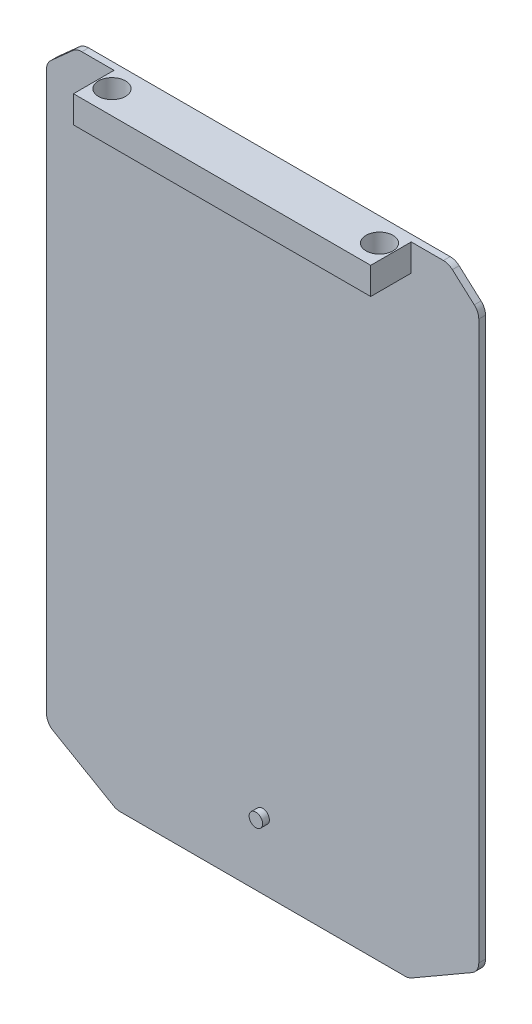
ISO-10303-21;
HEADER;
FILE_DESCRIPTION(('STEP AP214'),'2;1');
FILE_NAME('part.step','',(''),(''),'','','');
FILE_SCHEMA(('AUTOMOTIVE_DESIGN { 1 0 10303 214 1 1 1 1 }'));
ENDSEC;
DATA;
#1=APPLICATION_CONTEXT('core data for automotive mechanical design processes');
#2=APPLICATION_PROTOCOL_DEFINITION('international standard','automotive_design',2000,#1);
#3=PRODUCT_CONTEXT('',#1,'mechanical');
#4=PRODUCT('Part','Part','',(#3));
#5=PRODUCT_RELATED_PRODUCT_CATEGORY('part','',(#4));
#6=PRODUCT_DEFINITION_FORMATION('','',#4);
#7=PRODUCT_DEFINITION_CONTEXT('part definition',#1,'design');
#8=PRODUCT_DEFINITION('design','',#6,#7);
#9=PRODUCT_DEFINITION_SHAPE('','',#8);
#10=(LENGTH_UNIT() NAMED_UNIT(*) SI_UNIT(.MILLI.,.METRE.));
#11=(NAMED_UNIT(*) PLANE_ANGLE_UNIT() SI_UNIT($,.RADIAN.));
#12=(NAMED_UNIT(*) SI_UNIT($,.STERADIAN.) SOLID_ANGLE_UNIT());
#13=UNCERTAINTY_MEASURE_WITH_UNIT(LENGTH_MEASURE(1.E-05),#10,'distance_accuracy_value','');
#14=(GEOMETRIC_REPRESENTATION_CONTEXT(3) GLOBAL_UNCERTAINTY_ASSIGNED_CONTEXT((#13)) GLOBAL_UNIT_ASSIGNED_CONTEXT((#10,
#11,#12)) REPRESENTATION_CONTEXT('',''));
#15=CARTESIAN_POINT('',(0.,0.,0.));
#16=DIRECTION('',(0.,0.,1.));
#17=DIRECTION('',(1.,0.,0.));
#18=AXIS2_PLACEMENT_3D('',#15,#16,#17);
#19=CARTESIAN_POINT('',(0.,0.,5.));
#20=DIRECTION('',(0.,0.,1.));
#21=DIRECTION('',(1.,0.,0.));
#22=AXIS2_PLACEMENT_3D('',#19,#20,#21);
#23=PLANE('',#22);
#24=CARTESIAN_POINT('',(0.,-186.5,5.));
#25=DIRECTION('',(0.,0.,1.));
#26=DIRECTION('',(1.,0.,0.));
#27=AXIS2_PLACEMENT_3D('',#24,#25,#26);
#28=CIRCLE('',#27,5.);
#29=CARTESIAN_POINT('',(5.,-186.5,5.));
#30=VERTEX_POINT('',#29);
#31=EDGE_CURVE('E11',#30,#30,#28,.T.);
#32=ORIENTED_EDGE('',*,*,#31,.F.);
#33=EDGE_LOOP('',(#32));
#34=FACE_BOUND('',#33,.T.);
#35=DIRECTION('',(-1.,0.,0.));
#36=VECTOR('',#35,1.);
#37=CARTESIAN_POINT('',(0.,236.5,5.));
#38=LINE('',#37,#36);
#39=CARTESIAN_POINT('',(133.819660112501,236.5,5.));
#40=VERTEX_POINT('',#39);
#41=CARTESIAN_POINT('',(110.,236.5,5.));
#42=VERTEX_POINT('',#41);
#43=EDGE_CURVE('E280',#40,#42,#38,.T.);
#44=ORIENTED_EDGE('',*,*,#43,.T.);
#45=DIRECTION('',(0.,-1.,0.));
#46=VECTOR('',#45,1.);
#47=CARTESIAN_POINT('',(110.,226.5,5.));
#48=LINE('',#47,#46);
#49=CARTESIAN_POINT('',(110.,216.5,5.));
#50=VERTEX_POINT('',#49);
#51=EDGE_CURVE('E210',#42,#50,#48,.T.);
#52=ORIENTED_EDGE('',*,*,#51,.T.);
#53=DIRECTION('',(-1.,0.,0.));
#54=VECTOR('',#53,1.);
#55=CARTESIAN_POINT('',(0.,216.5,5.));
#56=LINE('',#55,#54);
#57=CARTESIAN_POINT('',(-110.,216.5,5.));
#58=VERTEX_POINT('',#57);
#59=EDGE_CURVE('E40',#50,#58,#56,.T.);
#60=ORIENTED_EDGE('',*,*,#59,.T.);
#61=DIRECTION('',(0.,1.,0.));
#62=VECTOR('',#61,1.);
#63=CARTESIAN_POINT('',(-110.,226.5,5.));
#64=LINE('',#63,#62);
#65=CARTESIAN_POINT('',(-110.,236.5,5.));
#66=VERTEX_POINT('',#65);
#67=EDGE_CURVE('E47',#58,#66,#64,.T.);
#68=ORIENTED_EDGE('',*,*,#67,.T.);
#69=CARTESIAN_POINT('',(-133.819660112501,236.5,5.));
#70=VERTEX_POINT('',#69);
#71=EDGE_CURVE('E278',#66,#70,#38,.T.);
#72=ORIENTED_EDGE('',*,*,#71,.T.);
#73=CARTESIAN_POINT('',(-133.819660112501,226.5,5.));
#74=DIRECTION('',(0.,0.,1.));
#75=DIRECTION('',(1.,0.,0.));
#76=AXIS2_PLACEMENT_3D('',#73,#74,#75);
#77=CIRCLE('',#76,10.);
#78=CARTESIAN_POINT('',(-140.486326779168,233.953559924999,5.));
#79=VERTEX_POINT('',#78);
#80=EDGE_CURVE('E348',#70,#79,#77,.T.);
#81=ORIENTED_EDGE('',*,*,#80,.T.);
#82=DIRECTION('',(0.745355992499928,0.666666666666669,0.));
#83=VECTOR('',#82,1.);
#84=CARTESIAN_POINT('',(-148.819660112501,226.5,5.));
#85=LINE('',#84,#83);
#86=CARTESIAN_POINT('',(-156.666666666667,219.481423969999,5.));
#87=VERTEX_POINT('',#86);
#88=EDGE_CURVE('E256',#87,#79,#85,.T.);
#89=ORIENTED_EDGE('',*,*,#88,.F.);
#90=CARTESIAN_POINT('',(-150.,212.027864045001,5.));
#91=DIRECTION('',(0.,0.,1.));
#92=DIRECTION('',(1.,0.,0.));
#93=AXIS2_PLACEMENT_3D('',#90,#91,#92);
#94=CIRCLE('',#93,10.);
#95=CARTESIAN_POINT('',(-160.,212.027864045001,5.));
#96=VERTEX_POINT('',#95);
#97=EDGE_CURVE('E345',#87,#96,#94,.T.);
#98=ORIENTED_EDGE('',*,*,#97,.T.);
#99=DIRECTION('',(0.,-1.,0.));
#100=VECTOR('',#99,1.);
#101=CARTESIAN_POINT('',(-160.,0.,5.));
#102=LINE('',#101,#100);
#103=CARTESIAN_POINT('',(-160.,-200.726497308104,5.));
#104=VERTEX_POINT('',#103);
#105=EDGE_CURVE('E283',#96,#104,#102,.T.);
#106=ORIENTED_EDGE('',*,*,#105,.T.);
#107=CARTESIAN_POINT('',(-150.,-200.726497308104,5.));
#108=DIRECTION('',(0.,0.,1.));
#109=DIRECTION('',(1.,0.,0.));
#110=AXIS2_PLACEMENT_3D('',#107,#108,#109);
#111=CIRCLE('',#110,10.);
#112=CARTESIAN_POINT('',(-155.,-209.386751345948,5.));
#113=VERTEX_POINT('',#112);
#114=EDGE_CURVE('E339',#104,#113,#111,.T.);
#115=ORIENTED_EDGE('',*,*,#114,.T.);
#116=DIRECTION('',(0.866025403784439,-0.5,0.));
#117=VECTOR('',#116,1.);
#118=CARTESIAN_POINT('',(-134.019237886467,-221.5,5.));
#119=LINE('',#118,#117);
#120=CARTESIAN_POINT('',(-110.358983848622,-235.160254037845,5.));
#121=VERTEX_POINT('',#120);
#122=EDGE_CURVE('E263',#113,#121,#119,.T.);
#123=ORIENTED_EDGE('',*,*,#122,.T.);
#124=CARTESIAN_POINT('',(-105.358983848622,-226.5,5.));
#125=DIRECTION('',(0.,0.,1.));
#126=DIRECTION('',(1.,0.,0.));
#127=AXIS2_PLACEMENT_3D('',#124,#125,#126);
#128=CIRCLE('',#127,10.);
#129=CARTESIAN_POINT('',(-105.358983848622,-236.5,5.));
#130=VERTEX_POINT('',#129);
#131=EDGE_CURVE('E342',#121,#130,#128,.T.);
#132=ORIENTED_EDGE('',*,*,#131,.T.);
#133=DIRECTION('',(-1.,0.,0.));
#134=VECTOR('',#133,1.);
#135=CARTESIAN_POINT('',(0.,-236.5,5.));
#136=LINE('',#135,#134);
#137=CARTESIAN_POINT('',(105.358983848622,-236.5,5.));
#138=VERTEX_POINT('',#137);
#139=EDGE_CURVE('E287',#138,#130,#136,.T.);
#140=ORIENTED_EDGE('',*,*,#139,.F.);
#141=CARTESIAN_POINT('',(105.358983848622,-226.5,5.));
#142=DIRECTION('',(0.,0.,1.));
#143=DIRECTION('',(1.,0.,0.));
#144=AXIS2_PLACEMENT_3D('',#141,#142,#143);
#145=CIRCLE('',#144,10.);
#146=CARTESIAN_POINT('',(110.358983848622,-235.160254037845,5.));
#147=VERTEX_POINT('',#146);
#148=EDGE_CURVE('E333',#138,#147,#145,.T.);
#149=ORIENTED_EDGE('',*,*,#148,.T.);
#150=DIRECTION('',(-0.866025403784439,-0.5,0.));
#151=VECTOR('',#150,1.);
#152=CARTESIAN_POINT('',(134.019237886467,-221.5,5.));
#153=LINE('',#152,#151);
#154=CARTESIAN_POINT('',(155.,-209.386751345948,5.));
#155=VERTEX_POINT('',#154);
#156=EDGE_CURVE('E258',#155,#147,#153,.T.);
#157=ORIENTED_EDGE('',*,*,#156,.F.);
#158=CARTESIAN_POINT('',(150.,-200.726497308103,5.));
#159=DIRECTION('',(0.,0.,1.));
#160=DIRECTION('',(1.,0.,0.));
#161=AXIS2_PLACEMENT_3D('',#158,#159,#160);
#162=CIRCLE('',#161,10.);
#163=CARTESIAN_POINT('',(160.,-200.726497308103,5.));
#164=VERTEX_POINT('',#163);
#165=EDGE_CURVE('E336',#155,#164,#162,.T.);
#166=ORIENTED_EDGE('',*,*,#165,.T.);
#167=DIRECTION('',(0.,-1.,0.));
#168=VECTOR('',#167,1.);
#169=CARTESIAN_POINT('',(160.,0.,5.));
#170=LINE('',#169,#168);
#171=CARTESIAN_POINT('',(160.,212.027864045001,5.));
#172=VERTEX_POINT('',#171);
#173=EDGE_CURVE('E274',#172,#164,#170,.T.);
#174=ORIENTED_EDGE('',*,*,#173,.F.);
#175=CARTESIAN_POINT('',(150.,212.027864045001,5.));
#176=DIRECTION('',(0.,0.,1.));
#177=DIRECTION('',(1.,0.,0.));
#178=AXIS2_PLACEMENT_3D('',#175,#176,#177);
#179=CIRCLE('',#178,10.);
#180=CARTESIAN_POINT('',(156.666666666667,219.481423969999,5.));
#181=VERTEX_POINT('',#180);
#182=EDGE_CURVE('E327',#172,#181,#179,.T.);
#183=ORIENTED_EDGE('',*,*,#182,.T.);
#184=DIRECTION('',(-0.74535599249993,0.666666666666667,0.));
#185=VECTOR('',#184,1.);
#186=CARTESIAN_POINT('',(148.819660112501,226.5,5.));
#187=LINE('',#186,#185);
#188=CARTESIAN_POINT('',(140.486326779168,233.953559924999,5.));
#189=VERTEX_POINT('',#188);
#190=EDGE_CURVE('E262',#181,#189,#187,.T.);
#191=ORIENTED_EDGE('',*,*,#190,.T.);
#192=CARTESIAN_POINT('',(133.819660112501,226.5,5.));
#193=DIRECTION('',(0.,0.,1.));
#194=DIRECTION('',(1.,0.,0.));
#195=AXIS2_PLACEMENT_3D('',#192,#193,#194);
#196=CIRCLE('',#195,10.);
#197=EDGE_CURVE('E330',#189,#40,#196,.T.);
#198=ORIENTED_EDGE('',*,*,#197,.T.);
#199=EDGE_LOOP('',(#44,#52,#60,#68,#72,#81,#89,#98,#106,#115,#123,#132,#140,#149,#157,#166,#174,
#183,#191,#198));
#200=FACE_BOUND('',#199,.T.);
#201=ADVANCED_FACE('F17',(#34,#200),#23,.T.);
#202=CARTESIAN_POINT('',(160.,0.,5.));
#203=DIRECTION('',(1.,0.,0.));
#204=DIRECTION('',(0.,1.,0.));
#205=AXIS2_PLACEMENT_3D('',#202,#203,#204);
#206=PLANE('',#205);
#207=ORIENTED_EDGE('',*,*,#173,.T.);
#208=DIRECTION('',(0.,0.,1.));
#209=VECTOR('',#208,1.);
#210=CARTESIAN_POINT('',(160.,-200.726497308103,0.));
#211=LINE('',#210,#209);
#212=CARTESIAN_POINT('',(160.,-200.726497308103,0.));
#213=VERTEX_POINT('',#212);
#214=EDGE_CURVE('E414',#164,#213,#211,.F.);
#215=ORIENTED_EDGE('',*,*,#214,.T.);
#216=DIRECTION('',(0.,-1.,0.));
#217=VECTOR('',#216,1.);
#218=CARTESIAN_POINT('',(160.,0.,0.));
#219=LINE('',#218,#217);
#220=CARTESIAN_POINT('',(160.,212.027864045001,0.));
#221=VERTEX_POINT('',#220);
#222=EDGE_CURVE('E273',#221,#213,#219,.T.);
#223=ORIENTED_EDGE('',*,*,#222,.F.);
#224=DIRECTION('',(0.,0.,1.));
#225=VECTOR('',#224,1.);
#226=CARTESIAN_POINT('',(160.,212.027864045001,5.));
#227=LINE('',#226,#225);
#228=EDGE_CURVE('E410',#221,#172,#227,.T.);
#229=ORIENTED_EDGE('',*,*,#228,.T.);
#230=EDGE_LOOP('',(#207,#215,#223,#229));
#231=FACE_BOUND('',#230,.T.);
#232=ADVANCED_FACE('F447',(#231),#206,.T.);
#233=CARTESIAN_POINT('',(0.,236.5,5.));
#234=DIRECTION('',(0.,-1.,0.));
#235=DIRECTION('',(1.,0.,0.));
#236=AXIS2_PLACEMENT_3D('',#233,#234,#235);
#237=PLANE('',#236);
#238=CARTESIAN_POINT('',(99.,236.5,17.5));
#239=DIRECTION('',(0.,1.,0.));
#240=DIRECTION('',(-1.,0.,0.));
#241=AXIS2_PLACEMENT_3D('',#238,#239,#240);
#242=CIRCLE('',#241,10.);
#243=CARTESIAN_POINT('',(89.,236.5,17.5));
#244=VERTEX_POINT('',#243);
#245=EDGE_CURVE('E425',#244,#244,#242,.T.);
#246=ORIENTED_EDGE('',*,*,#245,.F.);
#247=EDGE_LOOP('',(#246));
#248=FACE_BOUND('',#247,.T.);
#249=CARTESIAN_POINT('',(-99.,236.5,17.5));
#250=DIRECTION('',(0.,1.,0.));
#251=DIRECTION('',(-1.,0.,0.));
#252=AXIS2_PLACEMENT_3D('',#249,#250,#251);
#253=CIRCLE('',#252,10.);
#254=CARTESIAN_POINT('',(-109.,236.5,17.5));
#255=VERTEX_POINT('',#254);
#256=EDGE_CURVE('E237',#255,#255,#253,.T.);
#257=ORIENTED_EDGE('',*,*,#256,.F.);
#258=EDGE_LOOP('',(#257));
#259=FACE_BOUND('',#258,.T.);
#260=DIRECTION('',(-1.,0.,0.));
#261=VECTOR('',#260,1.);
#262=CARTESIAN_POINT('',(0.,236.5,0.));
#263=LINE('',#262,#261);
#264=CARTESIAN_POINT('',(133.819660112501,236.5,0.));
#265=VERTEX_POINT('',#264);
#266=CARTESIAN_POINT('',(-133.819660112501,236.5,0.));
#267=VERTEX_POINT('',#266);
#268=EDGE_CURVE('E295',#265,#267,#263,.T.);
#269=ORIENTED_EDGE('',*,*,#268,.T.);
#270=DIRECTION('',(0.,0.,1.));
#271=VECTOR('',#270,1.);
#272=CARTESIAN_POINT('',(-133.819660112501,236.5,5.));
#273=LINE('',#272,#271);
#274=EDGE_CURVE('E323',#267,#70,#273,.T.);
#275=ORIENTED_EDGE('',*,*,#274,.T.);
#276=ORIENTED_EDGE('',*,*,#71,.F.);
#277=DIRECTION('',(0.,0.,-1.));
#278=VECTOR('',#277,1.);
#279=CARTESIAN_POINT('',(-110.,236.5,35.));
#280=LINE('',#279,#278);
#281=CARTESIAN_POINT('',(-110.,236.5,35.));
#282=VERTEX_POINT('',#281);
#283=EDGE_CURVE('E215',#282,#66,#280,.T.);
#284=ORIENTED_EDGE('',*,*,#283,.F.);
#285=DIRECTION('',(-1.,0.,0.));
#286=VECTOR('',#285,1.);
#287=CARTESIAN_POINT('',(0.,236.5,35.));
#288=LINE('',#287,#286);
#289=CARTESIAN_POINT('',(110.,236.5,35.));
#290=VERTEX_POINT('',#289);
#291=EDGE_CURVE('E218',#290,#282,#288,.T.);
#292=ORIENTED_EDGE('',*,*,#291,.F.);
#293=DIRECTION('',(0.,0.,-1.));
#294=VECTOR('',#293,1.);
#295=CARTESIAN_POINT('',(110.,236.5,35.));
#296=LINE('',#295,#294);
#297=EDGE_CURVE('E203',#290,#42,#296,.T.);
#298=ORIENTED_EDGE('',*,*,#297,.T.);
#299=ORIENTED_EDGE('',*,*,#43,.F.);
#300=DIRECTION('',(0.,0.,1.));
#301=VECTOR('',#300,1.);
#302=CARTESIAN_POINT('',(133.819660112501,236.5,0.));
#303=LINE('',#302,#301);
#304=EDGE_CURVE('E320',#40,#265,#303,.F.);
#305=ORIENTED_EDGE('',*,*,#304,.T.);
#306=EDGE_LOOP('',(#269,#275,#276,#284,#292,#298,#299,#305));
#307=FACE_BOUND('',#306,.T.);
#308=ADVANCED_FACE('F220',(#248,#259,#307),#237,.F.);
#309=CARTESIAN_POINT('',(-160.,0.,5.));
#310=DIRECTION('',(1.,0.,0.));
#311=DIRECTION('',(0.,1.,0.));
#312=AXIS2_PLACEMENT_3D('',#309,#310,#311);
#313=PLANE('',#312);
#314=ORIENTED_EDGE('',*,*,#105,.F.);
#315=DIRECTION('',(0.,0.,1.));
#316=VECTOR('',#315,1.);
#317=CARTESIAN_POINT('',(-160.,212.027864045001,5.));
#318=LINE('',#317,#316);
#319=CARTESIAN_POINT('',(-160.,212.027864045001,0.));
#320=VERTEX_POINT('',#319);
#321=EDGE_CURVE('E386',#96,#320,#318,.F.);
#322=ORIENTED_EDGE('',*,*,#321,.T.);
#323=DIRECTION('',(0.,-1.,0.));
#324=VECTOR('',#323,1.);
#325=CARTESIAN_POINT('',(-160.,0.,0.));
#326=LINE('',#325,#324);
#327=CARTESIAN_POINT('',(-160.,-200.726497308104,0.));
#328=VERTEX_POINT('',#327);
#329=EDGE_CURVE('E298',#320,#328,#326,.T.);
#330=ORIENTED_EDGE('',*,*,#329,.T.);
#331=DIRECTION('',(0.,0.,1.));
#332=VECTOR('',#331,1.);
#333=CARTESIAN_POINT('',(-160.,-200.726497308104,5.));
#334=LINE('',#333,#332);
#335=EDGE_CURVE('E382',#328,#104,#334,.T.);
#336=ORIENTED_EDGE('',*,*,#335,.T.);
#337=EDGE_LOOP('',(#314,#322,#330,#336));
#338=FACE_BOUND('',#337,.T.);
#339=ADVANCED_FACE('F446',(#338),#313,.F.);
#340=CARTESIAN_POINT('',(0.,-236.5,5.));
#341=DIRECTION('',(0.,-1.,0.));
#342=DIRECTION('',(1.,0.,0.));
#343=AXIS2_PLACEMENT_3D('',#340,#341,#342);
#344=PLANE('',#343);
#345=ORIENTED_EDGE('',*,*,#139,.T.);
#346=DIRECTION('',(0.,0.,1.));
#347=VECTOR('',#346,1.);
#348=CARTESIAN_POINT('',(-105.358983848622,-236.5,5.));
#349=LINE('',#348,#347);
#350=CARTESIAN_POINT('',(-105.358983848622,-236.5,0.));
#351=VERTEX_POINT('',#350);
#352=EDGE_CURVE('E400',#130,#351,#349,.F.);
#353=ORIENTED_EDGE('',*,*,#352,.T.);
#354=DIRECTION('',(-1.,0.,0.));
#355=VECTOR('',#354,1.);
#356=CARTESIAN_POINT('',(0.,-236.5,0.));
#357=LINE('',#356,#355);
#358=CARTESIAN_POINT('',(105.358983848622,-236.5,0.));
#359=VERTEX_POINT('',#358);
#360=EDGE_CURVE('E279',#359,#351,#357,.T.);
#361=ORIENTED_EDGE('',*,*,#360,.F.);
#362=DIRECTION('',(0.,0.,1.));
#363=VECTOR('',#362,1.);
#364=CARTESIAN_POINT('',(105.358983848622,-236.5,5.));
#365=LINE('',#364,#363);
#366=EDGE_CURVE('E396',#359,#138,#365,.T.);
#367=ORIENTED_EDGE('',*,*,#366,.T.);
#368=EDGE_LOOP('',(#345,#353,#361,#367));
#369=FACE_BOUND('',#368,.T.);
#370=ADVANCED_FACE('F455',(#369),#344,.T.);
#371=CARTESIAN_POINT('',(0.,0.,0.));
#372=DIRECTION('',(0.,0.,1.));
#373=DIRECTION('',(1.,0.,0.));
#374=AXIS2_PLACEMENT_3D('',#371,#372,#373);
#375=PLANE('',#374);
#376=DIRECTION('',(0.745355992499928,0.666666666666669,0.));
#377=VECTOR('',#376,1.);
#378=CARTESIAN_POINT('',(-178.690826028602,199.78241697777,0.));
#379=LINE('',#378,#377);
#380=CARTESIAN_POINT('',(-156.666666666667,219.48142397,0.));
#381=VERTEX_POINT('',#380);
#382=CARTESIAN_POINT('',(-140.486326779168,233.953559924999,0.));
#383=VERTEX_POINT('',#382);
#384=EDGE_CURVE('E316',#381,#383,#379,.T.);
#385=ORIENTED_EDGE('',*,*,#384,.T.);
#386=CARTESIAN_POINT('',(-133.819660112501,226.5,0.));
#387=DIRECTION('',(0.,0.,1.));
#388=DIRECTION('',(1.,0.,0.));
#389=AXIS2_PLACEMENT_3D('',#386,#387,#388);
#390=CIRCLE('',#389,10.);
#391=EDGE_CURVE('E379',#383,#267,#390,.F.);
#392=ORIENTED_EDGE('',*,*,#391,.T.);
#393=ORIENTED_EDGE('',*,*,#268,.F.);
#394=CARTESIAN_POINT('',(133.819660112501,226.5,0.));
#395=DIRECTION('',(0.,0.,1.));
#396=DIRECTION('',(1.,0.,0.));
#397=AXIS2_PLACEMENT_3D('',#394,#395,#396);
#398=CIRCLE('',#397,10.);
#399=CARTESIAN_POINT('',(140.486326779168,233.953559924999,0.));
#400=VERTEX_POINT('',#399);
#401=EDGE_CURVE('E361',#265,#400,#398,.F.);
#402=ORIENTED_EDGE('',*,*,#401,.T.);
#403=DIRECTION('',(-0.74535599249993,0.666666666666667,0.));
#404=VECTOR('',#403,1.);
#405=CARTESIAN_POINT('',(178.690826028601,199.78241697777,0.));
#406=LINE('',#405,#404);
#407=CARTESIAN_POINT('',(156.666666666667,219.481423969999,0.));
#408=VERTEX_POINT('',#407);
#409=EDGE_CURVE('E291',#408,#400,#406,.T.);
#410=ORIENTED_EDGE('',*,*,#409,.F.);
#411=CARTESIAN_POINT('',(150.,212.027864045001,0.));
#412=DIRECTION('',(0.,0.,1.));
#413=DIRECTION('',(1.,0.,0.));
#414=AXIS2_PLACEMENT_3D('',#411,#412,#413);
#415=CIRCLE('',#414,10.);
#416=EDGE_CURVE('E358',#408,#221,#415,.F.);
#417=ORIENTED_EDGE('',*,*,#416,.T.);
#418=ORIENTED_EDGE('',*,*,#222,.T.);
#419=CARTESIAN_POINT('',(150.,-200.726497308103,0.));
#420=DIRECTION('',(0.,0.,1.));
#421=DIRECTION('',(1.,0.,0.));
#422=AXIS2_PLACEMENT_3D('',#419,#420,#421);
#423=CIRCLE('',#422,10.);
#424=CARTESIAN_POINT('',(155.,-209.386751345948,0.));
#425=VERTEX_POINT('',#424);
#426=EDGE_CURVE('E367',#213,#425,#423,.F.);
#427=ORIENTED_EDGE('',*,*,#426,.T.);
#428=DIRECTION('',(-0.866025403784439,-0.5,0.));
#429=VECTOR('',#428,1.);
#430=CARTESIAN_POINT('',(129.417122940743,-224.157032302755,0.));
#431=LINE('',#430,#429);
#432=CARTESIAN_POINT('',(110.358983848622,-235.160254037845,0.));
#433=VERTEX_POINT('',#432);
#434=EDGE_CURVE('E308',#425,#433,#431,.T.);
#435=ORIENTED_EDGE('',*,*,#434,.T.);
#436=CARTESIAN_POINT('',(105.358983848622,-226.5,0.));
#437=DIRECTION('',(0.,0.,1.));
#438=DIRECTION('',(1.,0.,0.));
#439=AXIS2_PLACEMENT_3D('',#436,#437,#438);
#440=CIRCLE('',#439,10.);
#441=EDGE_CURVE('E364',#433,#359,#440,.F.);
#442=ORIENTED_EDGE('',*,*,#441,.T.);
#443=ORIENTED_EDGE('',*,*,#360,.T.);
#444=CARTESIAN_POINT('',(-105.358983848622,-226.5,0.));
#445=DIRECTION('',(0.,0.,1.));
#446=DIRECTION('',(1.,0.,0.));
#447=AXIS2_PLACEMENT_3D('',#444,#445,#446);
#448=CIRCLE('',#447,10.);
#449=CARTESIAN_POINT('',(-110.358983848622,-235.160254037845,0.));
#450=VERTEX_POINT('',#449);
#451=EDGE_CURVE('E373',#351,#450,#448,.F.);
#452=ORIENTED_EDGE('',*,*,#451,.T.);
#453=DIRECTION('',(0.866025403784439,-0.5,0.));
#454=VECTOR('',#453,1.);
#455=CARTESIAN_POINT('',(-129.417122940743,-224.157032302755,0.));
#456=LINE('',#455,#454);
#457=CARTESIAN_POINT('',(-155.,-209.386751345948,0.));
#458=VERTEX_POINT('',#457);
#459=EDGE_CURVE('E312',#458,#450,#456,.T.);
#460=ORIENTED_EDGE('',*,*,#459,.F.);
#461=CARTESIAN_POINT('',(-150.,-200.726497308104,0.));
#462=DIRECTION('',(0.,0.,1.));
#463=DIRECTION('',(1.,0.,0.));
#464=AXIS2_PLACEMENT_3D('',#461,#462,#463);
#465=CIRCLE('',#464,10.);
#466=EDGE_CURVE('E370',#458,#328,#465,.F.);
#467=ORIENTED_EDGE('',*,*,#466,.T.);
#468=ORIENTED_EDGE('',*,*,#329,.F.);
#469=CARTESIAN_POINT('',(-150.,212.027864045001,0.));
#470=DIRECTION('',(0.,0.,1.));
#471=DIRECTION('',(1.,0.,0.));
#472=AXIS2_PLACEMENT_3D('',#469,#470,#471);
#473=CIRCLE('',#472,10.);
#474=EDGE_CURVE('E376',#320,#381,#473,.F.);
#475=ORIENTED_EDGE('',*,*,#474,.T.);
#476=EDGE_LOOP('',(#385,#392,#393,#402,#410,#417,#418,#427,#435,#442,#443,#452,#460,#467,#468,#475));
#477=FACE_BOUND('',#476,.T.);
#478=ADVANCED_FACE('F470',(#477),#375,.F.);
#479=CARTESIAN_POINT('',(148.819660112501,226.5,-20.));
#480=DIRECTION('',(0.666666666666667,0.74535599249993,0.));
#481=DIRECTION('',(-0.74535599249993,0.666666666666667,0.));
#482=AXIS2_PLACEMENT_3D('',#479,#480,#481);
#483=PLANE('',#482);
#484=ORIENTED_EDGE('',*,*,#409,.T.);
#485=DIRECTION('',(0.,0.,1.));
#486=VECTOR('',#485,1.);
#487=CARTESIAN_POINT('',(140.486326779168,233.953559924999,5.));
#488=LINE('',#487,#486);
#489=EDGE_CURVE('E27',#400,#189,#488,.T.);
#490=ORIENTED_EDGE('',*,*,#489,.T.);
#491=ORIENTED_EDGE('',*,*,#190,.F.);
#492=DIRECTION('',(0.,0.,1.));
#493=VECTOR('',#492,1.);
#494=CARTESIAN_POINT('',(156.666666666667,219.481423969999,-20.));
#495=LINE('',#494,#493);
#496=EDGE_CURVE('E417',#181,#408,#495,.F.);
#497=ORIENTED_EDGE('',*,*,#496,.T.);
#498=EDGE_LOOP('',(#484,#490,#491,#497));
#499=FACE_BOUND('',#498,.T.);
#500=ADVANCED_FACE('F468',(#499),#483,.T.);
#501=CARTESIAN_POINT('',(134.019237886467,-221.5,-20.));
#502=DIRECTION('',(-0.5,0.866025403784439,0.));
#503=DIRECTION('',(-0.866025403784439,-0.5,0.));
#504=AXIS2_PLACEMENT_3D('',#501,#502,#503);
#505=PLANE('',#504);
#506=ORIENTED_EDGE('',*,*,#434,.F.);
#507=DIRECTION('',(0.,0.,1.));
#508=VECTOR('',#507,1.);
#509=CARTESIAN_POINT('',(155.,-209.386751345948,5.));
#510=LINE('',#509,#508);
#511=EDGE_CURVE('E406',#425,#155,#510,.T.);
#512=ORIENTED_EDGE('',*,*,#511,.T.);
#513=ORIENTED_EDGE('',*,*,#156,.T.);
#514=DIRECTION('',(0.,0.,1.));
#515=VECTOR('',#514,1.);
#516=CARTESIAN_POINT('',(110.358983848622,-235.160254037845,0.));
#517=LINE('',#516,#515);
#518=EDGE_CURVE('E403',#147,#433,#517,.F.);
#519=ORIENTED_EDGE('',*,*,#518,.T.);
#520=EDGE_LOOP('',(#506,#512,#513,#519));
#521=FACE_BOUND('',#520,.T.);
#522=ADVANCED_FACE('F535',(#521),#505,.F.);
#523=CARTESIAN_POINT('',(-134.019237886467,-221.5,-20.));
#524=DIRECTION('',(-0.5,-0.866025403784439,0.));
#525=DIRECTION('',(0.866025403784439,-0.5,0.));
#526=AXIS2_PLACEMENT_3D('',#523,#524,#525);
#527=PLANE('',#526);
#528=ORIENTED_EDGE('',*,*,#459,.T.);
#529=DIRECTION('',(0.,0.,1.));
#530=VECTOR('',#529,1.);
#531=CARTESIAN_POINT('',(-110.358983848622,-235.160254037845,-20.));
#532=LINE('',#531,#530);
#533=EDGE_CURVE('E392',#450,#121,#532,.T.);
#534=ORIENTED_EDGE('',*,*,#533,.T.);
#535=ORIENTED_EDGE('',*,*,#122,.F.);
#536=DIRECTION('',(0.,0.,1.));
#537=VECTOR('',#536,1.);
#538=CARTESIAN_POINT('',(-155.,-209.386751345948,0.));
#539=LINE('',#538,#537);
#540=EDGE_CURVE('E389',#113,#458,#539,.F.);
#541=ORIENTED_EDGE('',*,*,#540,.T.);
#542=EDGE_LOOP('',(#528,#534,#535,#541));
#543=FACE_BOUND('',#542,.T.);
#544=ADVANCED_FACE('F489',(#543),#527,.T.);
#545=CARTESIAN_POINT('',(-148.819660112501,226.5,-20.));
#546=DIRECTION('',(0.666666666666669,-0.745355992499928,0.));
#547=DIRECTION('',(0.745355992499928,0.666666666666669,0.));
#548=AXIS2_PLACEMENT_3D('',#545,#546,#547);
#549=PLANE('',#548);
#550=ORIENTED_EDGE('',*,*,#88,.T.);
#551=DIRECTION('',(0.,0.,1.));
#552=VECTOR('',#551,1.);
#553=CARTESIAN_POINT('',(-140.486326779168,233.953559924999,-20.));
#554=LINE('',#553,#552);
#555=EDGE_CURVE('E355',#79,#383,#554,.F.);
#556=ORIENTED_EDGE('',*,*,#555,.T.);
#557=ORIENTED_EDGE('',*,*,#384,.F.);
#558=DIRECTION('',(0.,0.,1.));
#559=VECTOR('',#558,1.);
#560=CARTESIAN_POINT('',(-156.666666666667,219.481423969999,-20.));
#561=LINE('',#560,#559);
#562=EDGE_CURVE('E351',#381,#87,#561,.T.);
#563=ORIENTED_EDGE('',*,*,#562,.T.);
#564=EDGE_LOOP('',(#550,#556,#557,#563));
#565=FACE_BOUND('',#564,.T.);
#566=ADVANCED_FACE('F505',(#565),#549,.F.);
#567=CARTESIAN_POINT('',(-133.819660112501,226.5,5.));
#568=DIRECTION('',(0.,0.,1.));
#569=DIRECTION('',(1.,0.,0.));
#570=AXIS2_PLACEMENT_3D('',#567,#568,#569);
#571=CYLINDRICAL_SURFACE('',#570,10.);
#572=ORIENTED_EDGE('',*,*,#391,.F.);
#573=ORIENTED_EDGE('',*,*,#555,.F.);
#574=ORIENTED_EDGE('',*,*,#80,.F.);
#575=ORIENTED_EDGE('',*,*,#274,.F.);
#576=EDGE_LOOP('',(#572,#573,#574,#575));
#577=FACE_BOUND('',#576,.T.);
#578=ADVANCED_FACE('F510',(#577),#571,.T.);
#579=CARTESIAN_POINT('',(-150.,212.027864045001,-20.));
#580=DIRECTION('',(0.,0.,1.));
#581=DIRECTION('',(1.,0.,0.));
#582=AXIS2_PLACEMENT_3D('',#579,#580,#581);
#583=CYLINDRICAL_SURFACE('',#582,10.);
#584=ORIENTED_EDGE('',*,*,#474,.F.);
#585=ORIENTED_EDGE('',*,*,#321,.F.);
#586=ORIENTED_EDGE('',*,*,#97,.F.);
#587=ORIENTED_EDGE('',*,*,#562,.F.);
#588=EDGE_LOOP('',(#584,#585,#586,#587));
#589=FACE_BOUND('',#588,.T.);
#590=ADVANCED_FACE('F500',(#589),#583,.T.);
#591=CARTESIAN_POINT('',(-105.358983848622,-226.5,-20.));
#592=DIRECTION('',(0.,0.,1.));
#593=DIRECTION('',(1.,0.,0.));
#594=AXIS2_PLACEMENT_3D('',#591,#592,#593);
#595=CYLINDRICAL_SURFACE('',#594,10.);
#596=ORIENTED_EDGE('',*,*,#451,.F.);
#597=ORIENTED_EDGE('',*,*,#352,.F.);
#598=ORIENTED_EDGE('',*,*,#131,.F.);
#599=ORIENTED_EDGE('',*,*,#533,.F.);
#600=EDGE_LOOP('',(#596,#597,#598,#599));
#601=FACE_BOUND('',#600,.T.);
#602=ADVANCED_FACE('F484',(#601),#595,.T.);
#603=CARTESIAN_POINT('',(-150.,-200.726497308104,5.));
#604=DIRECTION('',(0.,0.,-1.));
#605=DIRECTION('',(-1.,0.,0.));
#606=AXIS2_PLACEMENT_3D('',#603,#604,#605);
#607=CYLINDRICAL_SURFACE('',#606,10.);
#608=ORIENTED_EDGE('',*,*,#466,.F.);
#609=ORIENTED_EDGE('',*,*,#540,.F.);
#610=ORIENTED_EDGE('',*,*,#114,.F.);
#611=ORIENTED_EDGE('',*,*,#335,.F.);
#612=EDGE_LOOP('',(#608,#609,#610,#611));
#613=FACE_BOUND('',#612,.T.);
#614=ADVANCED_FACE('F493',(#613),#607,.T.);
#615=CARTESIAN_POINT('',(150.,-200.726497308103,-20.));
#616=DIRECTION('',(0.,0.,-1.));
#617=DIRECTION('',(-1.,0.,0.));
#618=AXIS2_PLACEMENT_3D('',#615,#616,#617);
#619=CYLINDRICAL_SURFACE('',#618,10.);
#620=ORIENTED_EDGE('',*,*,#426,.F.);
#621=ORIENTED_EDGE('',*,*,#214,.F.);
#622=ORIENTED_EDGE('',*,*,#165,.F.);
#623=ORIENTED_EDGE('',*,*,#511,.F.);
#624=EDGE_LOOP('',(#620,#621,#622,#623));
#625=FACE_BOUND('',#624,.T.);
#626=ADVANCED_FACE('F530',(#625),#619,.T.);
#627=CARTESIAN_POINT('',(105.358983848622,-226.5,5.));
#628=DIRECTION('',(0.,0.,-1.));
#629=DIRECTION('',(-1.,0.,0.));
#630=AXIS2_PLACEMENT_3D('',#627,#628,#629);
#631=CYLINDRICAL_SURFACE('',#630,10.);
#632=ORIENTED_EDGE('',*,*,#441,.F.);
#633=ORIENTED_EDGE('',*,*,#518,.F.);
#634=ORIENTED_EDGE('',*,*,#148,.F.);
#635=ORIENTED_EDGE('',*,*,#366,.F.);
#636=EDGE_LOOP('',(#632,#633,#634,#635));
#637=FACE_BOUND('',#636,.T.);
#638=ADVANCED_FACE('F539',(#637),#631,.T.);
#639=CARTESIAN_POINT('',(133.819660112501,226.5,-20.));
#640=DIRECTION('',(0.,0.,-1.));
#641=DIRECTION('',(-1.,0.,0.));
#642=AXIS2_PLACEMENT_3D('',#639,#640,#641);
#643=CYLINDRICAL_SURFACE('',#642,10.);
#644=ORIENTED_EDGE('',*,*,#401,.F.);
#645=ORIENTED_EDGE('',*,*,#304,.F.);
#646=ORIENTED_EDGE('',*,*,#197,.F.);
#647=ORIENTED_EDGE('',*,*,#489,.F.);
#648=EDGE_LOOP('',(#644,#645,#646,#647));
#649=FACE_BOUND('',#648,.T.);
#650=ADVANCED_FACE('F516',(#649),#643,.T.);
#651=CARTESIAN_POINT('',(150.,212.027864045001,5.));
#652=DIRECTION('',(0.,0.,1.));
#653=DIRECTION('',(1.,0.,0.));
#654=AXIS2_PLACEMENT_3D('',#651,#652,#653);
#655=CYLINDRICAL_SURFACE('',#654,10.);
#656=ORIENTED_EDGE('',*,*,#416,.F.);
#657=ORIENTED_EDGE('',*,*,#496,.F.);
#658=ORIENTED_EDGE('',*,*,#182,.F.);
#659=ORIENTED_EDGE('',*,*,#228,.F.);
#660=EDGE_LOOP('',(#656,#657,#658,#659));
#661=FACE_BOUND('',#660,.T.);
#662=ADVANCED_FACE('F19',(#661),#655,.T.);
#663=CARTESIAN_POINT('',(0.,-186.5,10.));
#664=DIRECTION('',(0.,0.,-1.));
#665=DIRECTION('',(-1.,0.,0.));
#666=AXIS2_PLACEMENT_3D('',#663,#664,#665);
#667=CYLINDRICAL_SURFACE('',#666,5.);
#668=CARTESIAN_POINT('',(0.,-186.5,10.));
#669=DIRECTION('',(0.,0.,1.));
#670=DIRECTION('',(1.,0.,0.));
#671=AXIS2_PLACEMENT_3D('',#668,#669,#670);
#672=CIRCLE('',#671,5.);
#673=CARTESIAN_POINT('',(5.,-186.5,10.));
#674=VERTEX_POINT('',#673);
#675=EDGE_CURVE('E214',#674,#674,#672,.T.);
#676=ORIENTED_EDGE('',*,*,#675,.F.);
#677=EDGE_LOOP('',(#676));
#678=FACE_BOUND('',#677,.T.);
#679=ORIENTED_EDGE('',*,*,#31,.T.);
#680=EDGE_LOOP('',(#679));
#681=FACE_BOUND('',#680,.T.);
#682=ADVANCED_FACE('F558',(#678,#681),#667,.T.);
#683=CARTESIAN_POINT('',(0.,0.,10.));
#684=DIRECTION('',(0.,0.,1.));
#685=DIRECTION('',(1.,0.,0.));
#686=AXIS2_PLACEMENT_3D('',#683,#684,#685);
#687=PLANE('',#686);
#688=ORIENTED_EDGE('',*,*,#675,.T.);
#689=EDGE_LOOP('',(#688));
#690=FACE_BOUND('',#689,.T.);
#691=ADVANCED_FACE('F552',(#690),#687,.T.);
#692=CARTESIAN_POINT('',(110.,226.5,35.));
#693=DIRECTION('',(1.,0.,0.));
#694=DIRECTION('',(0.,0.,-1.));
#695=AXIS2_PLACEMENT_3D('',#692,#693,#694);
#696=PLANE('',#695);
#697=ORIENTED_EDGE('',*,*,#51,.F.);
#698=ORIENTED_EDGE('',*,*,#297,.F.);
#699=DIRECTION('',(0.,-1.,0.));
#700=VECTOR('',#699,1.);
#701=CARTESIAN_POINT('',(110.,226.5,35.));
#702=LINE('',#701,#700);
#703=CARTESIAN_POINT('',(110.,216.5,35.));
#704=VERTEX_POINT('',#703);
#705=EDGE_CURVE('E208',#290,#704,#702,.T.);
#706=ORIENTED_EDGE('',*,*,#705,.T.);
#707=DIRECTION('',(0.,0.,-1.));
#708=VECTOR('',#707,1.);
#709=CARTESIAN_POINT('',(110.,216.5,35.));
#710=LINE('',#709,#708);
#711=EDGE_CURVE('E244',#704,#50,#710,.T.);
#712=ORIENTED_EDGE('',*,*,#711,.T.);
#713=EDGE_LOOP('',(#697,#698,#706,#712));
#714=FACE_BOUND('',#713,.T.);
#715=ADVANCED_FACE('F205',(#714),#696,.T.);
#716=CARTESIAN_POINT('',(-110.,226.5,35.));
#717=DIRECTION('',(-1.,0.,0.));
#718=DIRECTION('',(0.,0.,1.));
#719=AXIS2_PLACEMENT_3D('',#716,#717,#718);
#720=PLANE('',#719);
#721=ORIENTED_EDGE('',*,*,#67,.F.);
#722=DIRECTION('',(0.,0.,-1.));
#723=VECTOR('',#722,1.);
#724=CARTESIAN_POINT('',(-110.,216.5,35.));
#725=LINE('',#724,#723);
#726=CARTESIAN_POINT('',(-110.,216.5,35.));
#727=VERTEX_POINT('',#726);
#728=EDGE_CURVE('E249',#727,#58,#725,.T.);
#729=ORIENTED_EDGE('',*,*,#728,.F.);
#730=DIRECTION('',(0.,1.,0.));
#731=VECTOR('',#730,1.);
#732=CARTESIAN_POINT('',(-110.,226.5,35.));
#733=LINE('',#732,#731);
#734=EDGE_CURVE('E225',#727,#282,#733,.T.);
#735=ORIENTED_EDGE('',*,*,#734,.T.);
#736=ORIENTED_EDGE('',*,*,#283,.T.);
#737=EDGE_LOOP('',(#721,#729,#735,#736));
#738=FACE_BOUND('',#737,.T.);
#739=ADVANCED_FACE('F543',(#738),#720,.T.);
#740=CARTESIAN_POINT('',(0.,216.5,35.));
#741=DIRECTION('',(0.,-1.,0.));
#742=DIRECTION('',(0.,0.,-1.));
#743=AXIS2_PLACEMENT_3D('',#740,#741,#742);
#744=PLANE('',#743);
#745=CARTESIAN_POINT('',(99.,216.5,17.5));
#746=DIRECTION('',(0.,-1.,0.));
#747=DIRECTION('',(0.,0.,-1.));
#748=AXIS2_PLACEMENT_3D('',#745,#746,#747);
#749=CIRCLE('',#748,10.);
#750=CARTESIAN_POINT('',(99.,216.5,7.5));
#751=VERTEX_POINT('',#750);
#752=EDGE_CURVE('E21',#751,#751,#749,.T.);
#753=ORIENTED_EDGE('',*,*,#752,.F.);
#754=EDGE_LOOP('',(#753));
#755=FACE_BOUND('',#754,.T.);
#756=CARTESIAN_POINT('',(-99.,216.5,17.5));
#757=DIRECTION('',(0.,-1.,0.));
#758=DIRECTION('',(0.,0.,-1.));
#759=AXIS2_PLACEMENT_3D('',#756,#757,#758);
#760=CIRCLE('',#759,10.);
#761=CARTESIAN_POINT('',(-99.,216.5,7.5));
#762=VERTEX_POINT('',#761);
#763=EDGE_CURVE('E422',#762,#762,#760,.T.);
#764=ORIENTED_EDGE('',*,*,#763,.F.);
#765=EDGE_LOOP('',(#764));
#766=FACE_BOUND('',#765,.T.);
#767=ORIENTED_EDGE('',*,*,#59,.F.);
#768=ORIENTED_EDGE('',*,*,#711,.F.);
#769=DIRECTION('',(-1.,0.,0.));
#770=VECTOR('',#769,1.);
#771=CARTESIAN_POINT('',(0.,216.5,35.));
#772=LINE('',#771,#770);
#773=EDGE_CURVE('E229',#704,#727,#772,.T.);
#774=ORIENTED_EDGE('',*,*,#773,.T.);
#775=ORIENTED_EDGE('',*,*,#728,.T.);
#776=EDGE_LOOP('',(#767,#768,#774,#775));
#777=FACE_BOUND('',#776,.T.);
#778=ADVANCED_FACE('F541',(#755,#766,#777),#744,.T.);
#779=CARTESIAN_POINT('',(0.,0.,35.));
#780=DIRECTION('',(0.,0.,1.));
#781=DIRECTION('',(1.,0.,0.));
#782=AXIS2_PLACEMENT_3D('',#779,#780,#781);
#783=PLANE('',#782);
#784=ORIENTED_EDGE('',*,*,#705,.F.);
#785=ORIENTED_EDGE('',*,*,#291,.T.);
#786=ORIENTED_EDGE('',*,*,#734,.F.);
#787=ORIENTED_EDGE('',*,*,#773,.F.);
#788=EDGE_LOOP('',(#784,#785,#786,#787));
#789=FACE_BOUND('',#788,.T.);
#790=ADVANCED_FACE('F227',(#789),#783,.T.);
#791=CARTESIAN_POINT('',(-99.,211.5,17.5));
#792=DIRECTION('',(0.,1.,0.));
#793=DIRECTION('',(-1.,0.,0.));
#794=AXIS2_PLACEMENT_3D('',#791,#792,#793);
#795=CYLINDRICAL_SURFACE('',#794,10.);
#796=ORIENTED_EDGE('',*,*,#763,.T.);
#797=EDGE_LOOP('',(#796));
#798=FACE_BOUND('',#797,.T.);
#799=ORIENTED_EDGE('',*,*,#256,.T.);
#800=EDGE_LOOP('',(#799));
#801=FACE_BOUND('',#800,.T.);
#802=ADVANCED_FACE('F443',(#798,#801),#795,.F.);
#803=CARTESIAN_POINT('',(99.,211.5,17.5));
#804=DIRECTION('',(0.,1.,0.));
#805=DIRECTION('',(-1.,0.,0.));
#806=AXIS2_PLACEMENT_3D('',#803,#804,#805);
#807=CYLINDRICAL_SURFACE('',#806,10.);
#808=ORIENTED_EDGE('',*,*,#752,.T.);
#809=EDGE_LOOP('',(#808));
#810=FACE_BOUND('',#809,.T.);
#811=ORIENTED_EDGE('',*,*,#245,.T.);
#812=EDGE_LOOP('',(#811));
#813=FACE_BOUND('',#812,.T.);
#814=ADVANCED_FACE('F631',(#810,#813),#807,.F.);
#815=CLOSED_SHELL('',(#201,#232,#308,#339,#370,#478,#500,#522,#544,#566,#578,#590,#602,#614,
#626,#638,#650,#662,#682,#691,#715,#739,#778,#790,#802,#814));
#816=MANIFOLD_SOLID_BREP('B1',#815);
#817=ADVANCED_BREP_SHAPE_REPRESENTATION('',(#18,#816),#14);
#818=SHAPE_DEFINITION_REPRESENTATION(#9,#817);
ENDSEC;
END-ISO-10303-21;
